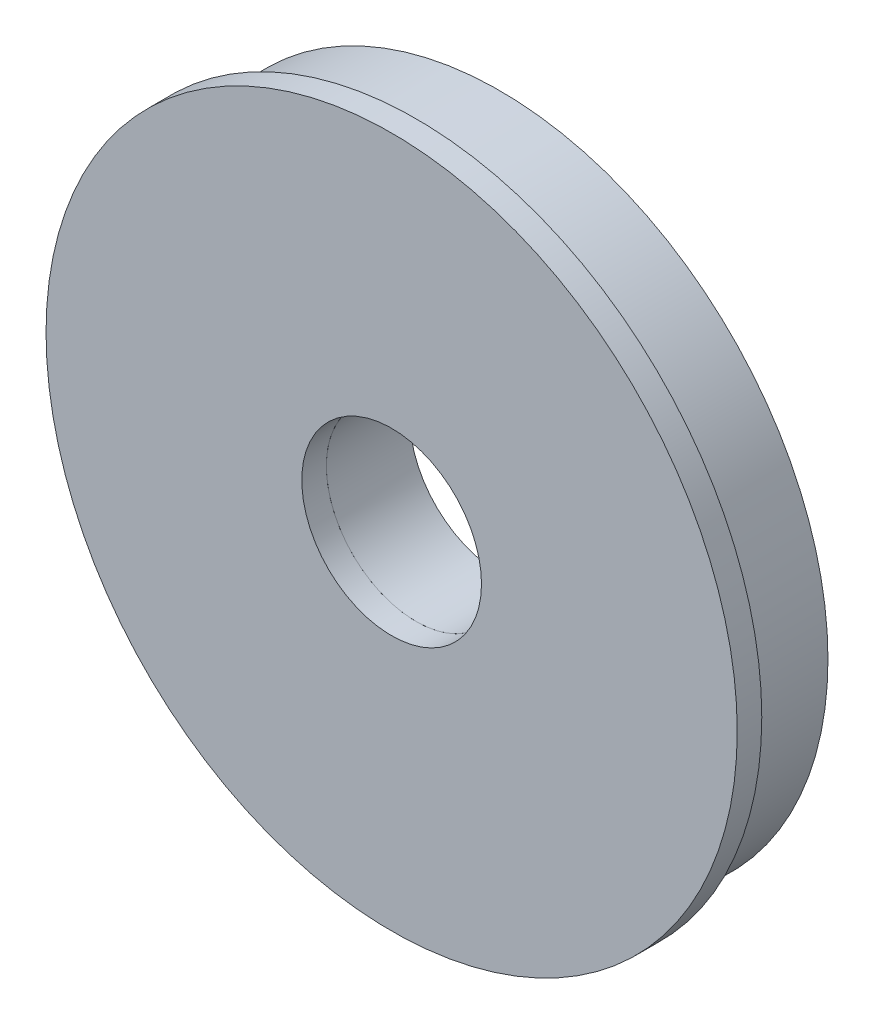
ISO-10303-21;
HEADER;
FILE_DESCRIPTION(('STEP AP214'),'2;1');
FILE_NAME('part.step','',(''),(''),'','','');
FILE_SCHEMA(('AUTOMOTIVE_DESIGN { 1 0 10303 214 1 1 1 1 }'));
ENDSEC;
DATA;
#1=APPLICATION_CONTEXT('core data for automotive mechanical design processes');
#2=APPLICATION_PROTOCOL_DEFINITION('international standard','automotive_design',2000,#1);
#3=PRODUCT_CONTEXT('',#1,'mechanical');
#4=PRODUCT('Part','Part','',(#3));
#5=PRODUCT_RELATED_PRODUCT_CATEGORY('part','',(#4));
#6=PRODUCT_DEFINITION_FORMATION('','',#4);
#7=PRODUCT_DEFINITION_CONTEXT('part definition',#1,'design');
#8=PRODUCT_DEFINITION('design','',#6,#7);
#9=PRODUCT_DEFINITION_SHAPE('','',#8);
#10=(LENGTH_UNIT() NAMED_UNIT(*) SI_UNIT(.MILLI.,.METRE.));
#11=(NAMED_UNIT(*) PLANE_ANGLE_UNIT() SI_UNIT($,.RADIAN.));
#12=(NAMED_UNIT(*) SI_UNIT($,.STERADIAN.) SOLID_ANGLE_UNIT());
#13=UNCERTAINTY_MEASURE_WITH_UNIT(LENGTH_MEASURE(1.E-05),#10,'distance_accuracy_value','');
#14=(GEOMETRIC_REPRESENTATION_CONTEXT(3) GLOBAL_UNCERTAINTY_ASSIGNED_CONTEXT((#13)) GLOBAL_UNIT_ASSIGNED_CONTEXT((#10,
#11,#12)) REPRESENTATION_CONTEXT('',''));
#15=CARTESIAN_POINT('',(0.,0.,0.));
#16=DIRECTION('',(0.,0.,1.));
#17=DIRECTION('',(1.,0.,0.));
#18=AXIS2_PLACEMENT_3D('',#15,#16,#17);
#19=CARTESIAN_POINT('',(0.,0.,-0.9017));
#20=DIRECTION('',(0.,0.,-1.));
#21=DIRECTION('',(-1.,0.,0.));
#22=AXIS2_PLACEMENT_3D('',#19,#20,#21);
#23=PLANE('',#22);
#24=CARTESIAN_POINT('',(0.,0.,-0.9017));
#25=DIRECTION('',(0.,0.,-1.));
#26=DIRECTION('',(-1.,0.,0.));
#27=AXIS2_PLACEMENT_3D('',#24,#25,#26);
#28=CIRCLE('',#27,12.065);
#29=CARTESIAN_POINT('',(-12.065,0.,-0.9017));
#30=VERTEX_POINT('',#29);
#31=EDGE_CURVE('E47',#30,#30,#28,.T.);
#32=ORIENTED_EDGE('',*,*,#31,.F.);
#33=EDGE_LOOP('',(#32));
#34=FACE_BOUND('',#33,.T.);
#35=CARTESIAN_POINT('',(0.,0.,-0.9017));
#36=DIRECTION('',(0.,0.,-1.));
#37=DIRECTION('',(-1.,0.,0.));
#38=AXIS2_PLACEMENT_3D('',#35,#36,#37);
#39=CIRCLE('',#38,3.302);
#40=CARTESIAN_POINT('',(-3.302,0.,-0.9017));
#41=VERTEX_POINT('',#40);
#42=EDGE_CURVE('E56',#41,#41,#39,.T.);
#43=ORIENTED_EDGE('',*,*,#42,.T.);
#44=EDGE_LOOP('',(#43));
#45=FACE_BOUND('',#44,.T.);
#46=ADVANCED_FACE('F40',(#34,#45),#23,.F.);
#47=CARTESIAN_POINT('',(0.,0.,-42.0624732600628));
#48=DIRECTION('',(0.,0.,1.));
#49=DIRECTION('',(1.,0.,0.));
#50=AXIS2_PLACEMENT_3D('',#47,#48,#49);
#51=CYLINDRICAL_SURFACE('',#50,12.065);
#52=CARTESIAN_POINT('',(0.,0.,-3.96875));
#53=DIRECTION('',(0.,0.,1.));
#54=DIRECTION('',(1.,0.,0.));
#55=AXIS2_PLACEMENT_3D('',#52,#53,#54);
#56=CIRCLE('',#55,12.065);
#57=CARTESIAN_POINT('',(12.065,0.,-3.96875));
#58=VERTEX_POINT('',#57);
#59=EDGE_CURVE('E51',#58,#58,#56,.T.);
#60=ORIENTED_EDGE('',*,*,#59,.T.);
#61=EDGE_LOOP('',(#60));
#62=FACE_BOUND('',#61,.T.);
#63=ORIENTED_EDGE('',*,*,#31,.T.);
#64=EDGE_LOOP('',(#63));
#65=FACE_BOUND('',#64,.T.);
#66=ADVANCED_FACE('F64',(#62,#65),#51,.T.);
#67=CARTESIAN_POINT('',(0.,0.,-42.0624732600628));
#68=DIRECTION('',(0.,0.,1.));
#69=DIRECTION('',(1.,0.,0.));
#70=AXIS2_PLACEMENT_3D('',#67,#68,#69);
#71=CYLINDRICAL_SURFACE('',#70,3.302);
#72=CARTESIAN_POINT('',(0.,0.,-3.96875));
#73=DIRECTION('',(0.,0.,1.));
#74=DIRECTION('',(1.,0.,0.));
#75=AXIS2_PLACEMENT_3D('',#72,#73,#74);
#76=CIRCLE('',#75,3.302);
#77=CARTESIAN_POINT('',(3.302,0.,-3.96875));
#78=VERTEX_POINT('',#77);
#79=EDGE_CURVE('E11',#78,#78,#76,.T.);
#80=ORIENTED_EDGE('',*,*,#79,.F.);
#81=EDGE_LOOP('',(#80));
#82=FACE_BOUND('',#81,.T.);
#83=ORIENTED_EDGE('',*,*,#42,.F.);
#84=EDGE_LOOP('',(#83));
#85=FACE_BOUND('',#84,.T.);
#86=ADVANCED_FACE('F62',(#82,#85),#71,.F.);
#87=CARTESIAN_POINT('',(0.,0.,-3.96875));
#88=DIRECTION('',(0.,0.,1.));
#89=DIRECTION('',(1.,0.,0.));
#90=AXIS2_PLACEMENT_3D('',#87,#88,#89);
#91=PLANE('',#90);
#92=ORIENTED_EDGE('',*,*,#79,.T.);
#93=EDGE_LOOP('',(#92));
#94=FACE_BOUND('',#93,.T.);
#95=ORIENTED_EDGE('',*,*,#59,.F.);
#96=EDGE_LOOP('',(#95));
#97=FACE_BOUND('',#96,.T.);
#98=ADVANCED_FACE('F42',(#94,#97),#91,.F.);
#99=CLOSED_SHELL('',(#46,#66,#86,#98));
#100=MANIFOLD_SOLID_BREP('B2',#99);
#101=CARTESIAN_POINT('',(0.,0.,-0.9017));
#102=DIRECTION('',(0.,0.,1.));
#103=DIRECTION('',(1.,0.,0.));
#104=AXIS2_PLACEMENT_3D('',#101,#102,#103);
#105=CYLINDRICAL_SURFACE('',#104,12.7);
#106=CARTESIAN_POINT('',(0.,0.,-0.9017));
#107=DIRECTION('',(0.,0.,1.));
#108=DIRECTION('',(1.,0.,0.));
#109=AXIS2_PLACEMENT_3D('',#106,#107,#108);
#110=CIRCLE('',#109,12.7);
#111=CARTESIAN_POINT('',(12.7,0.,-0.9017));
#112=VERTEX_POINT('',#111);
#113=EDGE_CURVE('E39',#112,#112,#110,.T.);
#114=ORIENTED_EDGE('',*,*,#113,.T.);
#115=EDGE_LOOP('',(#114));
#116=FACE_BOUND('',#115,.T.);
#117=CARTESIAN_POINT('',(0.,0.,0.));
#118=DIRECTION('',(0.,0.,1.));
#119=DIRECTION('',(1.,0.,0.));
#120=AXIS2_PLACEMENT_3D('',#117,#118,#119);
#121=CIRCLE('',#120,12.7);
#122=CARTESIAN_POINT('',(12.7,0.,0.));
#123=VERTEX_POINT('',#122);
#124=EDGE_CURVE('E106',#123,#123,#121,.T.);
#125=ORIENTED_EDGE('',*,*,#124,.F.);
#126=EDGE_LOOP('',(#125));
#127=FACE_BOUND('',#126,.T.);
#128=ADVANCED_FACE('F103',(#116,#127),#105,.T.);
#129=CARTESIAN_POINT('',(0.,0.,-0.9017));
#130=DIRECTION('',(0.,0.,1.));
#131=DIRECTION('',(1.,0.,0.));
#132=AXIS2_PLACEMENT_3D('',#129,#130,#131);
#133=PLANE('',#132);
#134=CARTESIAN_POINT('',(0.,0.,-0.9017));
#135=DIRECTION('',(0.,0.,1.));
#136=DIRECTION('',(1.,0.,0.));
#137=AXIS2_PLACEMENT_3D('',#134,#135,#136);
#138=CIRCLE('',#137,3.302);
#139=CARTESIAN_POINT('',(3.302,0.,-0.9017));
#140=VERTEX_POINT('',#139);
#141=EDGE_CURVE('E113',#140,#140,#138,.T.);
#142=ORIENTED_EDGE('',*,*,#141,.T.);
#143=EDGE_LOOP('',(#142));
#144=FACE_BOUND('',#143,.T.);
#145=ORIENTED_EDGE('',*,*,#113,.F.);
#146=EDGE_LOOP('',(#145));
#147=FACE_BOUND('',#146,.T.);
#148=ADVANCED_FACE('F121',(#144,#147),#133,.F.);
#149=CARTESIAN_POINT('',(0.,0.,0.));
#150=DIRECTION('',(0.,0.,1.));
#151=DIRECTION('',(1.,0.,0.));
#152=AXIS2_PLACEMENT_3D('',#149,#150,#151);
#153=PLANE('',#152);
#154=CARTESIAN_POINT('',(0.,0.,0.));
#155=DIRECTION('',(0.,0.,1.));
#156=DIRECTION('',(1.,0.,0.));
#157=AXIS2_PLACEMENT_3D('',#154,#155,#156);
#158=CIRCLE('',#157,3.302);
#159=CARTESIAN_POINT('',(3.302,0.,0.));
#160=VERTEX_POINT('',#159);
#161=EDGE_CURVE('E115',#160,#160,#158,.T.);
#162=ORIENTED_EDGE('',*,*,#161,.F.);
#163=EDGE_LOOP('',(#162));
#164=FACE_BOUND('',#163,.T.);
#165=ORIENTED_EDGE('',*,*,#124,.T.);
#166=EDGE_LOOP('',(#165));
#167=FACE_BOUND('',#166,.T.);
#168=ADVANCED_FACE('F127',(#164,#167),#153,.T.);
#169=CARTESIAN_POINT('',(0.,0.,-0.9017));
#170=DIRECTION('',(0.,0.,1.));
#171=DIRECTION('',(1.,0.,0.));
#172=AXIS2_PLACEMENT_3D('',#169,#170,#171);
#173=CYLINDRICAL_SURFACE('',#172,3.302);
#174=ORIENTED_EDGE('',*,*,#141,.F.);
#175=EDGE_LOOP('',(#174));
#176=FACE_BOUND('',#175,.T.);
#177=ORIENTED_EDGE('',*,*,#161,.T.);
#178=EDGE_LOOP('',(#177));
#179=FACE_BOUND('',#178,.T.);
#180=ADVANCED_FACE('F124',(#176,#179),#173,.F.);
#181=CLOSED_SHELL('',(#128,#148,#168,#180));
#182=MANIFOLD_SOLID_BREP('B6',#181);
#183=ADVANCED_BREP_SHAPE_REPRESENTATION('',(#18,#100,#182),#14);
#184=SHAPE_DEFINITION_REPRESENTATION(#9,#183);
ENDSEC;
END-ISO-10303-21;
